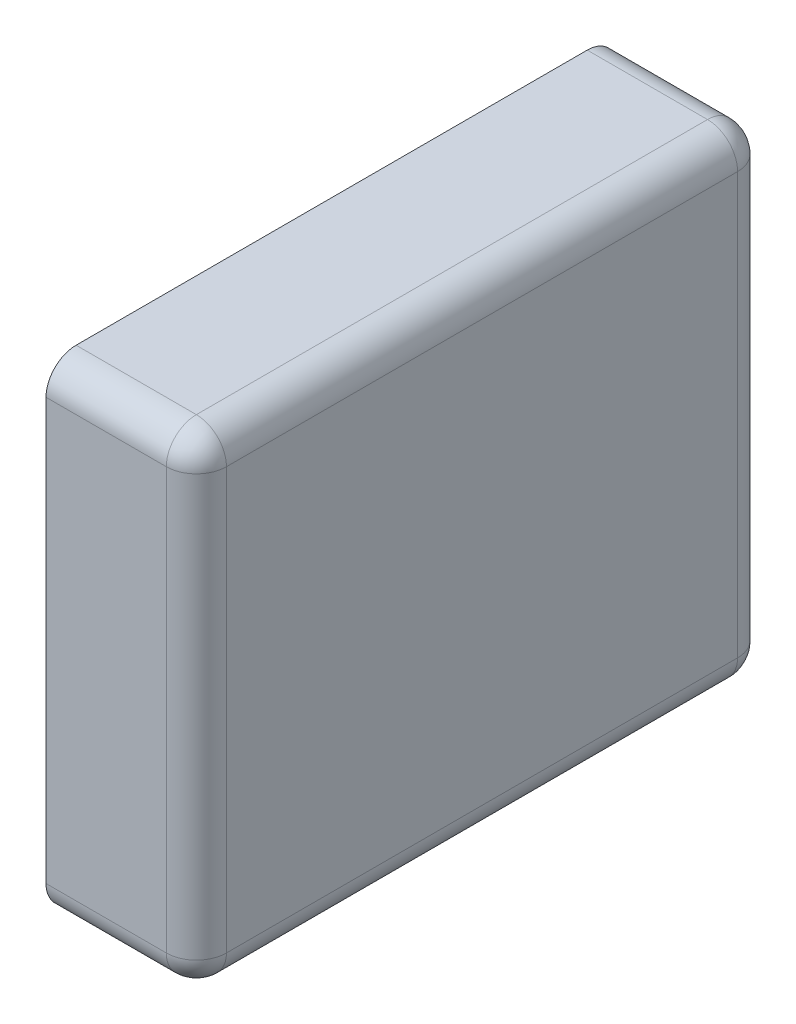
ISO-10303-21;
HEADER;
FILE_DESCRIPTION(('STEP AP214'),'2;1');
FILE_NAME('part.step','',(''),(''),'','','');
FILE_SCHEMA(('AUTOMOTIVE_DESIGN { 1 0 10303 214 1 1 1 1 }'));
ENDSEC;
DATA;
#1=APPLICATION_CONTEXT('core data for automotive mechanical design processes');
#2=APPLICATION_PROTOCOL_DEFINITION('international standard','automotive_design',2000,#1);
#3=PRODUCT_CONTEXT('',#1,'mechanical');
#4=PRODUCT('Part','Part','',(#3));
#5=PRODUCT_RELATED_PRODUCT_CATEGORY('part','',(#4));
#6=PRODUCT_DEFINITION_FORMATION('','',#4);
#7=PRODUCT_DEFINITION_CONTEXT('part definition',#1,'design');
#8=PRODUCT_DEFINITION('design','',#6,#7);
#9=PRODUCT_DEFINITION_SHAPE('','',#8);
#10=(LENGTH_UNIT() NAMED_UNIT(*) SI_UNIT(.MILLI.,.METRE.));
#11=(NAMED_UNIT(*) PLANE_ANGLE_UNIT() SI_UNIT($,.RADIAN.));
#12=(NAMED_UNIT(*) SI_UNIT($,.STERADIAN.) SOLID_ANGLE_UNIT());
#13=UNCERTAINTY_MEASURE_WITH_UNIT(LENGTH_MEASURE(1.E-05),#10,'distance_accuracy_value','');
#14=(GEOMETRIC_REPRESENTATION_CONTEXT(3) GLOBAL_UNCERTAINTY_ASSIGNED_CONTEXT((#13)) GLOBAL_UNIT_ASSIGNED_CONTEXT((#10,
#11,#12)) REPRESENTATION_CONTEXT('',''));
#15=CARTESIAN_POINT('',(0.,0.,0.));
#16=DIRECTION('',(0.,0.,1.));
#17=DIRECTION('',(1.,0.,0.));
#18=AXIS2_PLACEMENT_3D('',#15,#16,#17);
#19=CARTESIAN_POINT('',(1.6,0.,0.));
#20=DIRECTION('',(1.,0.,0.));
#21=DIRECTION('',(0.,0.,-1.));
#22=AXIS2_PLACEMENT_3D('',#19,#20,#21);
#23=PLANE('',#22);
#24=DIRECTION('',(0.,0.,1.));
#25=VECTOR('',#24,1.);
#26=CARTESIAN_POINT('',(1.6,0.7,0.));
#27=LINE('',#26,#25);
#28=CARTESIAN_POINT('',(1.6,0.7,1.8));
#29=VERTEX_POINT('',#28);
#30=CARTESIAN_POINT('',(1.6,0.7,0.1));
#31=VERTEX_POINT('',#30);
#32=EDGE_CURVE('E101',#29,#31,#27,.F.);
#33=ORIENTED_EDGE('',*,*,#32,.F.);
#34=DIRECTION('',(0.,-1.,0.));
#35=VECTOR('',#34,1.);
#36=CARTESIAN_POINT('',(1.6,0.,1.8));
#37=LINE('',#36,#35);
#38=CARTESIAN_POINT('',(1.6,-0.7005,1.8));
#39=VERTEX_POINT('',#38);
#40=EDGE_CURVE('E153',#39,#29,#37,.F.);
#41=ORIENTED_EDGE('',*,*,#40,.F.);
#42=DIRECTION('',(0.,0.,-1.));
#43=VECTOR('',#42,1.);
#44=CARTESIAN_POINT('',(1.6,-0.7005,0.));
#45=LINE('',#44,#43);
#46=CARTESIAN_POINT('',(1.6,-0.7005,0.1));
#47=VERTEX_POINT('',#46);
#48=EDGE_CURVE('E116',#47,#39,#45,.F.);
#49=ORIENTED_EDGE('',*,*,#48,.F.);
#50=DIRECTION('',(0.,1.,0.));
#51=VECTOR('',#50,1.);
#52=CARTESIAN_POINT('',(1.6,0.,0.1));
#53=LINE('',#52,#51);
#54=EDGE_CURVE('E113',#31,#47,#53,.F.);
#55=ORIENTED_EDGE('',*,*,#54,.F.);
#56=EDGE_LOOP('',(#33,#41,#49,#55));
#57=FACE_BOUND('',#56,.T.);
#58=ADVANCED_FACE('F17',(#57),#23,.T.);
#59=CARTESIAN_POINT('',(1.5,0.7,0.1));
#60=DIRECTION('',(-1.,0.,0.));
#61=DIRECTION('',(0.,1.,0.));
#62=AXIS2_PLACEMENT_3D('',#59,#60,#61);
#63=SPHERICAL_SURFACE('',#62,0.1);
#64=CARTESIAN_POINT('',(1.5,0.7,0.1));
#65=DIRECTION('',(0.,0.,1.));
#66=DIRECTION('',(0.,-1.,0.));
#67=AXIS2_PLACEMENT_3D('',#64,#65,#66);
#68=CIRCLE('',#67,0.1);
#69=CARTESIAN_POINT('',(1.5,0.8,0.1));
#70=VERTEX_POINT('',#69);
#71=EDGE_CURVE('E106',#31,#70,#68,.T.);
#72=ORIENTED_EDGE('',*,*,#71,.F.);
#73=CARTESIAN_POINT('',(1.5,0.7,0.0999999999999999));
#74=DIRECTION('',(0.,1.,0.));
#75=DIRECTION('',(0.,0.,1.));
#76=AXIS2_PLACEMENT_3D('',#73,#74,#75);
#77=CIRCLE('',#76,0.1);
#78=CARTESIAN_POINT('',(1.5,0.7,0.));
#79=VERTEX_POINT('',#78);
#80=EDGE_CURVE('E118',#79,#31,#77,.F.);
#81=ORIENTED_EDGE('',*,*,#80,.F.);
#82=CARTESIAN_POINT('',(1.5,0.7,0.1));
#83=DIRECTION('',(-1.,0.,0.));
#84=DIRECTION('',(0.,0.,1.));
#85=AXIS2_PLACEMENT_3D('',#82,#83,#84);
#86=CIRCLE('',#85,0.1);
#87=EDGE_CURVE('E127',#70,#79,#86,.T.);
#88=ORIENTED_EDGE('',*,*,#87,.F.);
#89=EDGE_LOOP('',(#72,#81,#88));
#90=FACE_BOUND('',#89,.T.);
#91=ADVANCED_FACE('F126',(#90),#63,.T.);
#92=CARTESIAN_POINT('',(1.5,0.7,0.));
#93=DIRECTION('',(0.,0.,1.));
#94=DIRECTION('',(0.,-1.,0.));
#95=AXIS2_PLACEMENT_3D('',#92,#93,#94);
#96=CYLINDRICAL_SURFACE('',#95,0.1);
#97=CARTESIAN_POINT('',(1.5,0.7,1.8));
#98=DIRECTION('',(0.,0.,-1.));
#99=DIRECTION('',(-1.,0.,0.));
#100=AXIS2_PLACEMENT_3D('',#97,#98,#99);
#101=CIRCLE('',#100,0.1);
#102=CARTESIAN_POINT('',(1.5,0.8,1.8));
#103=VERTEX_POINT('',#102);
#104=EDGE_CURVE('E108',#29,#103,#101,.F.);
#105=ORIENTED_EDGE('',*,*,#104,.F.);
#106=ORIENTED_EDGE('',*,*,#32,.T.);
#107=ORIENTED_EDGE('',*,*,#71,.T.);
#108=DIRECTION('',(0.,0.,-1.));
#109=VECTOR('',#108,1.);
#110=CARTESIAN_POINT('',(1.5,0.8,0.));
#111=LINE('',#110,#109);
#112=EDGE_CURVE('E226',#70,#103,#111,.F.);
#113=ORIENTED_EDGE('',*,*,#112,.T.);
#114=EDGE_LOOP('',(#105,#106,#107,#113));
#115=FACE_BOUND('',#114,.T.);
#116=ADVANCED_FACE('F103',(#115),#96,.T.);
#117=CARTESIAN_POINT('',(1.5,0.7,1.8));
#118=DIRECTION('',(-1.,0.,0.));
#119=DIRECTION('',(0.,1.,0.));
#120=AXIS2_PLACEMENT_3D('',#117,#118,#119);
#121=SPHERICAL_SURFACE('',#120,0.1);
#122=CARTESIAN_POINT('',(1.5,0.7,1.8));
#123=DIRECTION('',(0.,-1.,0.));
#124=DIRECTION('',(0.,0.,-1.));
#125=AXIS2_PLACEMENT_3D('',#122,#123,#124);
#126=CIRCLE('',#125,0.1);
#127=CARTESIAN_POINT('',(1.5,0.7,1.9));
#128=VERTEX_POINT('',#127);
#129=EDGE_CURVE('E156',#29,#128,#126,.T.);
#130=ORIENTED_EDGE('',*,*,#129,.F.);
#131=ORIENTED_EDGE('',*,*,#104,.T.);
#132=CARTESIAN_POINT('',(1.5,0.7,1.8));
#133=DIRECTION('',(-1.,0.,0.));
#134=DIRECTION('',(0.,0.,1.));
#135=AXIS2_PLACEMENT_3D('',#132,#133,#134);
#136=CIRCLE('',#135,0.1);
#137=EDGE_CURVE('E220',#128,#103,#136,.T.);
#138=ORIENTED_EDGE('',*,*,#137,.F.);
#139=EDGE_LOOP('',(#130,#131,#138));
#140=FACE_BOUND('',#139,.T.);
#141=ADVANCED_FACE('F142',(#140),#121,.T.);
#142=CARTESIAN_POINT('',(1.5,0.,1.8));
#143=DIRECTION('',(0.,-1.,0.));
#144=DIRECTION('',(0.,0.,-1.));
#145=AXIS2_PLACEMENT_3D('',#142,#143,#144);
#146=CYLINDRICAL_SURFACE('',#145,0.1);
#147=ORIENTED_EDGE('',*,*,#129,.T.);
#148=DIRECTION('',(0.,1.,0.));
#149=VECTOR('',#148,1.);
#150=CARTESIAN_POINT('',(1.5,-0.8005,1.9));
#151=LINE('',#150,#149);
#152=CARTESIAN_POINT('',(1.5,-0.700499999999808,1.9));
#153=VERTEX_POINT('',#152);
#154=EDGE_CURVE('E215',#128,#153,#151,.F.);
#155=ORIENTED_EDGE('',*,*,#154,.T.);
#156=CARTESIAN_POINT('',(1.5,-0.7005,1.8));
#157=DIRECTION('',(0.,1.,-7.66590628801683E-12));
#158=DIRECTION('',(-1.,0.,0.));
#159=AXIS2_PLACEMENT_3D('',#156,#157,#158);
#160=CIRCLE('',#159,0.1);
#161=EDGE_CURVE('E160',#39,#153,#160,.F.);
#162=ORIENTED_EDGE('',*,*,#161,.F.);
#163=ORIENTED_EDGE('',*,*,#40,.T.);
#164=EDGE_LOOP('',(#147,#155,#162,#163));
#165=FACE_BOUND('',#164,.T.);
#166=ADVANCED_FACE('F146',(#165),#146,.T.);
#167=CARTESIAN_POINT('',(1.5,-0.7005,1.8));
#168=DIRECTION('',(-1.,0.,0.));
#169=DIRECTION('',(0.,1.,0.));
#170=AXIS2_PLACEMENT_3D('',#167,#168,#169);
#171=SPHERICAL_SURFACE('',#170,0.1);
#172=ORIENTED_EDGE('',*,*,#161,.T.);
#173=CARTESIAN_POINT('',(1.5,-0.7005,1.8));
#174=DIRECTION('',(-1.,0.,0.));
#175=DIRECTION('',(0.,0.,1.));
#176=AXIS2_PLACEMENT_3D('',#173,#174,#175);
#177=CIRCLE('',#176,0.1);
#178=CARTESIAN_POINT('',(1.5,-0.8005,1.8));
#179=VERTEX_POINT('',#178);
#180=EDGE_CURVE('E210',#179,#153,#177,.T.);
#181=ORIENTED_EDGE('',*,*,#180,.F.);
#182=CARTESIAN_POINT('',(1.5,-0.7005,1.8));
#183=DIRECTION('',(0.,0.,-1.));
#184=DIRECTION('',(0.,1.,0.));
#185=AXIS2_PLACEMENT_3D('',#182,#183,#184);
#186=CIRCLE('',#185,0.1);
#187=EDGE_CURVE('E296',#39,#179,#186,.T.);
#188=ORIENTED_EDGE('',*,*,#187,.F.);
#189=EDGE_LOOP('',(#172,#181,#188));
#190=FACE_BOUND('',#189,.T.);
#191=ADVANCED_FACE('F260',(#190),#171,.T.);
#192=CARTESIAN_POINT('',(1.5,-0.7005,0.));
#193=DIRECTION('',(0.,0.,-1.));
#194=DIRECTION('',(0.,1.,0.));
#195=AXIS2_PLACEMENT_3D('',#192,#193,#194);
#196=CYLINDRICAL_SURFACE('',#195,0.1);
#197=ORIENTED_EDGE('',*,*,#187,.T.);
#198=DIRECTION('',(0.,0.,1.));
#199=VECTOR('',#198,1.);
#200=CARTESIAN_POINT('',(1.5,-0.8005,0.));
#201=LINE('',#200,#199);
#202=CARTESIAN_POINT('',(1.5,-0.8005,0.099999999999976));
#203=VERTEX_POINT('',#202);
#204=EDGE_CURVE('E205',#179,#203,#201,.F.);
#205=ORIENTED_EDGE('',*,*,#204,.T.);
#206=CARTESIAN_POINT('',(1.5,-0.7005,0.1));
#207=DIRECTION('',(0.,-9.58244934931425E-13,1.));
#208=DIRECTION('',(-1.,0.,0.));
#209=AXIS2_PLACEMENT_3D('',#206,#207,#208);
#210=CIRCLE('',#209,0.1);
#211=EDGE_CURVE('E124',#47,#203,#210,.F.);
#212=ORIENTED_EDGE('',*,*,#211,.F.);
#213=ORIENTED_EDGE('',*,*,#48,.T.);
#214=EDGE_LOOP('',(#197,#205,#212,#213));
#215=FACE_BOUND('',#214,.T.);
#216=ADVANCED_FACE('F256',(#215),#196,.T.);
#217=CARTESIAN_POINT('',(1.5,-0.7005,0.1));
#218=DIRECTION('',(-1.,0.,0.));
#219=DIRECTION('',(0.,1.,0.));
#220=AXIS2_PLACEMENT_3D('',#217,#218,#219);
#221=SPHERICAL_SURFACE('',#220,0.1);
#222=ORIENTED_EDGE('',*,*,#211,.T.);
#223=CARTESIAN_POINT('',(1.5,-0.7005,0.1));
#224=DIRECTION('',(-1.,0.,0.));
#225=DIRECTION('',(0.,0.,1.));
#226=AXIS2_PLACEMENT_3D('',#223,#224,#225);
#227=CIRCLE('',#226,0.1);
#228=CARTESIAN_POINT('',(1.5,-0.7005,0.));
#229=VERTEX_POINT('',#228);
#230=EDGE_CURVE('E199',#229,#203,#227,.T.);
#231=ORIENTED_EDGE('',*,*,#230,.F.);
#232=CARTESIAN_POINT('',(1.5,-0.7005,0.1));
#233=DIRECTION('',(0.,1.,0.));
#234=DIRECTION('',(0.,0.,1.));
#235=AXIS2_PLACEMENT_3D('',#232,#233,#234);
#236=CIRCLE('',#235,0.1);
#237=EDGE_CURVE('E66',#47,#229,#236,.T.);
#238=ORIENTED_EDGE('',*,*,#237,.F.);
#239=EDGE_LOOP('',(#222,#231,#238));
#240=FACE_BOUND('',#239,.T.);
#241=ADVANCED_FACE('F252',(#240),#221,.T.);
#242=CARTESIAN_POINT('',(1.5,0.,0.1));
#243=DIRECTION('',(0.,1.,0.));
#244=DIRECTION('',(0.,0.,1.));
#245=AXIS2_PLACEMENT_3D('',#242,#243,#244);
#246=CYLINDRICAL_SURFACE('',#245,0.1);
#247=ORIENTED_EDGE('',*,*,#237,.T.);
#248=DIRECTION('',(0.,-1.,0.));
#249=VECTOR('',#248,1.);
#250=CARTESIAN_POINT('',(1.5,-0.8005,0.));
#251=LINE('',#250,#249);
#252=EDGE_CURVE('E122',#229,#79,#251,.F.);
#253=ORIENTED_EDGE('',*,*,#252,.T.);
#254=ORIENTED_EDGE('',*,*,#80,.T.);
#255=ORIENTED_EDGE('',*,*,#54,.T.);
#256=EDGE_LOOP('',(#247,#253,#254,#255));
#257=FACE_BOUND('',#256,.T.);
#258=ADVANCED_FACE('F121',(#257),#246,.T.);
#259=CARTESIAN_POINT('',(1.6,0.7,0.1));
#260=DIRECTION('',(-1.,0.,0.));
#261=DIRECTION('',(0.,0.,1.));
#262=AXIS2_PLACEMENT_3D('',#259,#260,#261);
#263=CYLINDRICAL_SURFACE('',#262,0.1);
#264=ORIENTED_EDGE('',*,*,#87,.T.);
#265=DIRECTION('',(1.,0.,0.));
#266=VECTOR('',#265,1.);
#267=CARTESIAN_POINT('',(1.6,0.7,0.));
#268=LINE('',#267,#266);
#269=CARTESIAN_POINT('',(1.1,0.7,0.));
#270=VERTEX_POINT('',#269);
#271=EDGE_CURVE('E191',#79,#270,#268,.F.);
#272=ORIENTED_EDGE('',*,*,#271,.T.);
#273=CARTESIAN_POINT('',(1.1,0.7,0.1));
#274=DIRECTION('',(-1.,0.,0.));
#275=DIRECTION('',(0.,0.,1.));
#276=AXIS2_PLACEMENT_3D('',#273,#274,#275);
#277=CIRCLE('',#276,0.1);
#278=CARTESIAN_POINT('',(1.1,0.8,0.1));
#279=VERTEX_POINT('',#278);
#280=EDGE_CURVE('E20',#270,#279,#277,.F.);
#281=ORIENTED_EDGE('',*,*,#280,.T.);
#282=DIRECTION('',(1.,0.,0.));
#283=VECTOR('',#282,1.);
#284=CARTESIAN_POINT('',(1.6,0.8,0.1));
#285=LINE('',#284,#283);
#286=EDGE_CURVE('E223',#279,#70,#285,.T.);
#287=ORIENTED_EDGE('',*,*,#286,.T.);
#288=EDGE_LOOP('',(#264,#272,#281,#287));
#289=FACE_BOUND('',#288,.T.);
#290=ADVANCED_FACE('F332',(#289),#263,.T.);
#291=CARTESIAN_POINT('',(1.6,0.8,0.));
#292=DIRECTION('',(0.,-1.,0.));
#293=DIRECTION('',(0.,0.,-1.));
#294=AXIS2_PLACEMENT_3D('',#291,#292,#293);
#295=PLANE('',#294);
#296=DIRECTION('',(-1.,0.,0.));
#297=VECTOR('',#296,1.);
#298=CARTESIAN_POINT('',(1.6,0.8,1.8));
#299=LINE('',#298,#297);
#300=CARTESIAN_POINT('',(1.1,0.8,1.8));
#301=VERTEX_POINT('',#300);
#302=EDGE_CURVE('E216',#103,#301,#299,.T.);
#303=ORIENTED_EDGE('',*,*,#302,.F.);
#304=ORIENTED_EDGE('',*,*,#112,.F.);
#305=ORIENTED_EDGE('',*,*,#286,.F.);
#306=DIRECTION('',(0.,0.,-1.));
#307=VECTOR('',#306,1.);
#308=CARTESIAN_POINT('',(1.1,0.8,0.));
#309=LINE('',#308,#307);
#310=EDGE_CURVE('E178',#279,#301,#309,.F.);
#311=ORIENTED_EDGE('',*,*,#310,.T.);
#312=EDGE_LOOP('',(#303,#304,#305,#311));
#313=FACE_BOUND('',#312,.T.);
#314=ADVANCED_FACE('F277',(#313),#295,.F.);
#315=CARTESIAN_POINT('',(1.6,0.7,1.8));
#316=DIRECTION('',(-1.,0.,0.));
#317=DIRECTION('',(0.,0.,1.));
#318=AXIS2_PLACEMENT_3D('',#315,#316,#317);
#319=CYLINDRICAL_SURFACE('',#318,0.1);
#320=ORIENTED_EDGE('',*,*,#137,.T.);
#321=ORIENTED_EDGE('',*,*,#302,.T.);
#322=CARTESIAN_POINT('',(1.1,0.7,1.8));
#323=DIRECTION('',(-1.,0.,0.));
#324=DIRECTION('',(0.,0.,1.));
#325=AXIS2_PLACEMENT_3D('',#322,#323,#324);
#326=CIRCLE('',#325,0.1);
#327=CARTESIAN_POINT('',(1.1,0.7,1.9));
#328=VERTEX_POINT('',#327);
#329=EDGE_CURVE('E176',#301,#328,#326,.F.);
#330=ORIENTED_EDGE('',*,*,#329,.T.);
#331=DIRECTION('',(1.,0.,0.));
#332=VECTOR('',#331,1.);
#333=CARTESIAN_POINT('',(1.6,0.7,1.9));
#334=LINE('',#333,#332);
#335=EDGE_CURVE('E213',#328,#128,#334,.T.);
#336=ORIENTED_EDGE('',*,*,#335,.T.);
#337=EDGE_LOOP('',(#320,#321,#330,#336));
#338=FACE_BOUND('',#337,.T.);
#339=ADVANCED_FACE('F278',(#338),#319,.T.);
#340=CARTESIAN_POINT('',(1.6,-0.8005,1.9));
#341=DIRECTION('',(0.,0.,-1.));
#342=DIRECTION('',(0.,1.,0.));
#343=AXIS2_PLACEMENT_3D('',#340,#341,#342);
#344=PLANE('',#343);
#345=DIRECTION('',(-1.,0.,0.));
#346=VECTOR('',#345,1.);
#347=CARTESIAN_POINT('',(1.6,-0.7005,1.9));
#348=LINE('',#347,#346);
#349=CARTESIAN_POINT('',(1.1,-0.7005,1.9));
#350=VERTEX_POINT('',#349);
#351=EDGE_CURVE('E206',#153,#350,#348,.T.);
#352=ORIENTED_EDGE('',*,*,#351,.F.);
#353=ORIENTED_EDGE('',*,*,#154,.F.);
#354=ORIENTED_EDGE('',*,*,#335,.F.);
#355=DIRECTION('',(0.,1.,0.));
#356=VECTOR('',#355,1.);
#357=CARTESIAN_POINT('',(1.1,0.,1.9));
#358=LINE('',#357,#356);
#359=EDGE_CURVE('E175',#328,#350,#358,.F.);
#360=ORIENTED_EDGE('',*,*,#359,.T.);
#361=EDGE_LOOP('',(#352,#353,#354,#360));
#362=FACE_BOUND('',#361,.T.);
#363=ADVANCED_FACE('F286',(#362),#344,.F.);
#364=CARTESIAN_POINT('',(1.6,-0.7005,1.8));
#365=DIRECTION('',(-1.,0.,0.));
#366=DIRECTION('',(0.,0.,1.));
#367=AXIS2_PLACEMENT_3D('',#364,#365,#366);
#368=CYLINDRICAL_SURFACE('',#367,0.1);
#369=ORIENTED_EDGE('',*,*,#180,.T.);
#370=ORIENTED_EDGE('',*,*,#351,.T.);
#371=CARTESIAN_POINT('',(1.1,-0.7005,1.8));
#372=DIRECTION('',(-1.,0.,0.));
#373=DIRECTION('',(0.,0.,1.));
#374=AXIS2_PLACEMENT_3D('',#371,#372,#373);
#375=CIRCLE('',#374,0.1);
#376=CARTESIAN_POINT('',(1.1,-0.8005,1.8));
#377=VERTEX_POINT('',#376);
#378=EDGE_CURVE('E173',#350,#377,#375,.F.);
#379=ORIENTED_EDGE('',*,*,#378,.T.);
#380=DIRECTION('',(1.,0.,0.));
#381=VECTOR('',#380,1.);
#382=CARTESIAN_POINT('',(1.6,-0.8005,1.8));
#383=LINE('',#382,#381);
#384=EDGE_CURVE('E202',#377,#179,#383,.T.);
#385=ORIENTED_EDGE('',*,*,#384,.T.);
#386=EDGE_LOOP('',(#369,#370,#379,#385));
#387=FACE_BOUND('',#386,.T.);
#388=ADVANCED_FACE('F307',(#387),#368,.T.);
#389=CARTESIAN_POINT('',(1.6,-0.8005,0.));
#390=DIRECTION('',(0.,1.,0.));
#391=DIRECTION('',(0.,0.,1.));
#392=AXIS2_PLACEMENT_3D('',#389,#390,#391);
#393=PLANE('',#392);
#394=DIRECTION('',(-1.,0.,0.));
#395=VECTOR('',#394,1.);
#396=CARTESIAN_POINT('',(1.6,-0.8005,0.1));
#397=LINE('',#396,#395);
#398=CARTESIAN_POINT('',(1.1,-0.8005,0.1));
#399=VERTEX_POINT('',#398);
#400=EDGE_CURVE('E195',#203,#399,#397,.T.);
#401=ORIENTED_EDGE('',*,*,#400,.F.);
#402=ORIENTED_EDGE('',*,*,#204,.F.);
#403=ORIENTED_EDGE('',*,*,#384,.F.);
#404=DIRECTION('',(0.,0.,-1.));
#405=VECTOR('',#404,1.);
#406=CARTESIAN_POINT('',(1.1,-0.8005,0.));
#407=LINE('',#406,#405);
#408=EDGE_CURVE('E172',#377,#399,#407,.T.);
#409=ORIENTED_EDGE('',*,*,#408,.T.);
#410=EDGE_LOOP('',(#401,#402,#403,#409));
#411=FACE_BOUND('',#410,.T.);
#412=ADVANCED_FACE('F305',(#411),#393,.F.);
#413=CARTESIAN_POINT('',(1.6,-0.7005,0.1));
#414=DIRECTION('',(-1.,0.,0.));
#415=DIRECTION('',(0.,0.,1.));
#416=AXIS2_PLACEMENT_3D('',#413,#414,#415);
#417=CYLINDRICAL_SURFACE('',#416,0.1);
#418=ORIENTED_EDGE('',*,*,#230,.T.);
#419=ORIENTED_EDGE('',*,*,#400,.T.);
#420=CARTESIAN_POINT('',(1.1,-0.7005,0.1));
#421=DIRECTION('',(-1.,0.,0.));
#422=DIRECTION('',(0.,0.,1.));
#423=AXIS2_PLACEMENT_3D('',#420,#421,#422);
#424=CIRCLE('',#423,0.1);
#425=CARTESIAN_POINT('',(1.1,-0.7005,0.));
#426=VERTEX_POINT('',#425);
#427=EDGE_CURVE('E26',#399,#426,#424,.F.);
#428=ORIENTED_EDGE('',*,*,#427,.T.);
#429=DIRECTION('',(1.,0.,0.));
#430=VECTOR('',#429,1.);
#431=CARTESIAN_POINT('',(1.6,-0.7005,0.));
#432=LINE('',#431,#430);
#433=EDGE_CURVE('E34',#426,#229,#432,.T.);
#434=ORIENTED_EDGE('',*,*,#433,.T.);
#435=EDGE_LOOP('',(#418,#419,#428,#434));
#436=FACE_BOUND('',#435,.T.);
#437=ADVANCED_FACE('F315',(#436),#417,.T.);
#438=CARTESIAN_POINT('',(1.6,-0.8005,0.));
#439=DIRECTION('',(0.,0.,1.));
#440=DIRECTION('',(0.,-1.,0.));
#441=AXIS2_PLACEMENT_3D('',#438,#439,#440);
#442=PLANE('',#441);
#443=ORIENTED_EDGE('',*,*,#433,.F.);
#444=DIRECTION('',(0.,1.,0.));
#445=VECTOR('',#444,1.);
#446=CARTESIAN_POINT('',(1.1,0.,0.));
#447=LINE('',#446,#445);
#448=EDGE_CURVE('E11',#426,#270,#447,.T.);
#449=ORIENTED_EDGE('',*,*,#448,.T.);
#450=ORIENTED_EDGE('',*,*,#271,.F.);
#451=ORIENTED_EDGE('',*,*,#252,.F.);
#452=EDGE_LOOP('',(#443,#449,#450,#451));
#453=FACE_BOUND('',#452,.T.);
#454=ADVANCED_FACE('F319',(#453),#442,.F.);
#455=CARTESIAN_POINT('',(1.1,0.,0.));
#456=DIRECTION('',(1.,0.,0.));
#457=DIRECTION('',(0.,0.,-1.));
#458=AXIS2_PLACEMENT_3D('',#455,#456,#457);
#459=PLANE('',#458);
#460=ORIENTED_EDGE('',*,*,#427,.F.);
#461=ORIENTED_EDGE('',*,*,#408,.F.);
#462=ORIENTED_EDGE('',*,*,#378,.F.);
#463=ORIENTED_EDGE('',*,*,#359,.F.);
#464=ORIENTED_EDGE('',*,*,#329,.F.);
#465=ORIENTED_EDGE('',*,*,#310,.F.);
#466=ORIENTED_EDGE('',*,*,#280,.F.);
#467=ORIENTED_EDGE('',*,*,#448,.F.);
#468=EDGE_LOOP('',(#460,#461,#462,#463,#464,#465,#466,#467));
#469=FACE_BOUND('',#468,.T.);
#470=ADVANCED_FACE('F281',(#469),#459,.F.);
#471=CLOSED_SHELL('',(#58,#91,#116,#141,#166,#191,#216,#241,#258,#290,#314,#339,#363,#388,#412,
#437,#454,#470));
#472=MANIFOLD_SOLID_BREP('B1',#471);
#473=ADVANCED_BREP_SHAPE_REPRESENTATION('',(#18,#472),#14);
#474=SHAPE_DEFINITION_REPRESENTATION(#9,#473);
ENDSEC;
END-ISO-10303-21;
